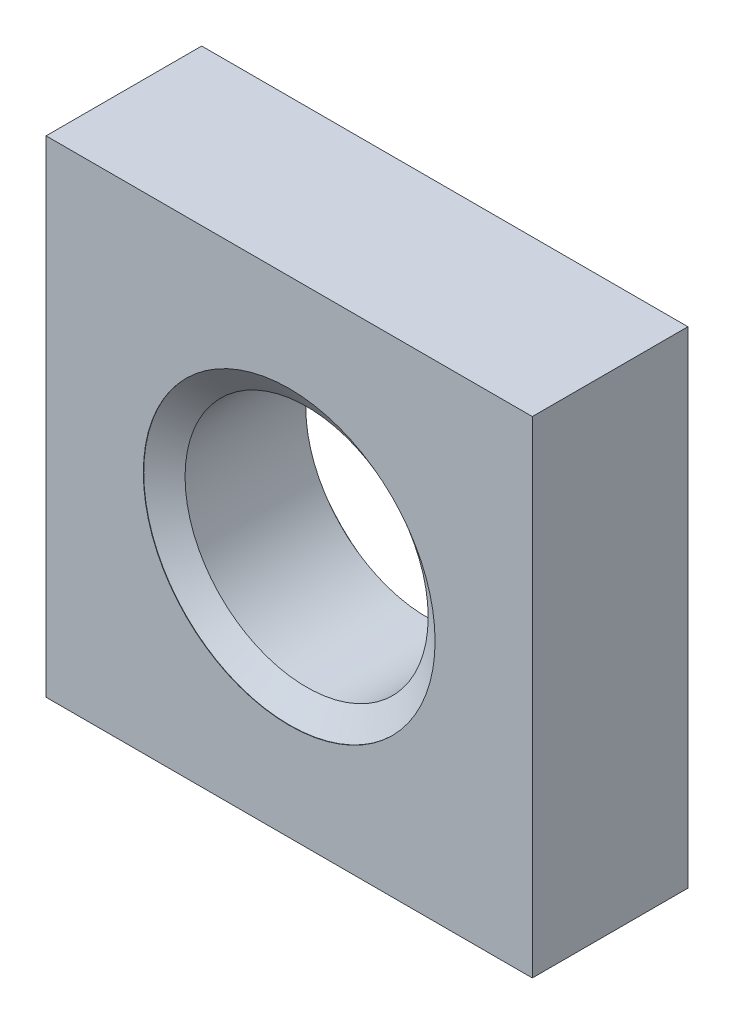
ISO-10303-21;
HEADER;
FILE_DESCRIPTION(('STEP AP214'),'2;1');
FILE_NAME('part.step','',(''),(''),'','','');
FILE_SCHEMA(('AUTOMOTIVE_DESIGN { 1 0 10303 214 1 1 1 1 }'));
ENDSEC;
DATA;
#1=APPLICATION_CONTEXT('core data for automotive mechanical design processes');
#2=APPLICATION_PROTOCOL_DEFINITION('international standard','automotive_design',2000,#1);
#3=PRODUCT_CONTEXT('',#1,'mechanical');
#4=PRODUCT('Part','Part','',(#3));
#5=PRODUCT_RELATED_PRODUCT_CATEGORY('part','',(#4));
#6=PRODUCT_DEFINITION_FORMATION('','',#4);
#7=PRODUCT_DEFINITION_CONTEXT('part definition',#1,'design');
#8=PRODUCT_DEFINITION('design','',#6,#7);
#9=PRODUCT_DEFINITION_SHAPE('','',#8);
#10=(LENGTH_UNIT() NAMED_UNIT(*) SI_UNIT(.MILLI.,.METRE.));
#11=(NAMED_UNIT(*) PLANE_ANGLE_UNIT() SI_UNIT($,.RADIAN.));
#12=(NAMED_UNIT(*) SI_UNIT($,.STERADIAN.) SOLID_ANGLE_UNIT());
#13=UNCERTAINTY_MEASURE_WITH_UNIT(LENGTH_MEASURE(1.E-05),#10,'distance_accuracy_value','');
#14=(GEOMETRIC_REPRESENTATION_CONTEXT(3) GLOBAL_UNCERTAINTY_ASSIGNED_CONTEXT((#13)) GLOBAL_UNIT_ASSIGNED_CONTEXT((#10,
#11,#12)) REPRESENTATION_CONTEXT('',''));
#15=CARTESIAN_POINT('',(0.,0.,0.));
#16=DIRECTION('',(0.,0.,1.));
#17=DIRECTION('',(1.,0.,0.));
#18=AXIS2_PLACEMENT_3D('',#15,#16,#17);
#19=CARTESIAN_POINT('',(0.,0.,-3.2));
#20=DIRECTION('',(0.,0.,1.));
#21=DIRECTION('',(1.,0.,0.));
#22=AXIS2_PLACEMENT_3D('',#19,#20,#21);
#23=CYLINDRICAL_SURFACE('',#22,2.5);
#24=CARTESIAN_POINT('',(0.,0.,-0.358103769104856));
#25=DIRECTION('',(0.,0.,1.));
#26=DIRECTION('',(1.,0.,0.));
#27=AXIS2_PLACEMENT_3D('',#24,#25,#26);
#28=CIRCLE('',#27,2.5);
#29=CARTESIAN_POINT('',(2.5,0.,-0.358103769104856));
#30=VERTEX_POINT('',#29);
#31=EDGE_CURVE('E117',#30,#30,#28,.F.);
#32=ORIENTED_EDGE('',*,*,#31,.F.);
#33=EDGE_LOOP('',(#32));
#34=FACE_BOUND('',#33,.T.);
#35=CARTESIAN_POINT('',(0.,0.,-2.84089623089514));
#36=DIRECTION('',(0.,0.,-1.));
#37=DIRECTION('',(-1.,0.,0.));
#38=AXIS2_PLACEMENT_3D('',#35,#36,#37);
#39=CIRCLE('',#38,2.5);
#40=CARTESIAN_POINT('',(-2.5,0.,-2.84089623089514));
#41=VERTEX_POINT('',#40);
#42=EDGE_CURVE('E41',#41,#41,#39,.F.);
#43=ORIENTED_EDGE('',*,*,#42,.F.);
#44=EDGE_LOOP('',(#43));
#45=FACE_BOUND('',#44,.T.);
#46=ADVANCED_FACE('F37',(#34,#45),#23,.F.);
#47=CARTESIAN_POINT('',(-5.,5.,-3.2));
#48=DIRECTION('',(0.,0.,-1.));
#49=DIRECTION('',(-1.,0.,0.));
#50=AXIS2_PLACEMENT_3D('',#47,#48,#49);
#51=PLANE('',#50);
#52=DIRECTION('',(0.,-1.,0.));
#53=VECTOR('',#52,1.);
#54=CARTESIAN_POINT('',(-5.,-5.,-3.2));
#55=LINE('',#54,#53);
#56=CARTESIAN_POINT('',(-5.,5.,-3.2));
#57=VERTEX_POINT('',#56);
#58=CARTESIAN_POINT('',(-5.,-5.,-3.2));
#59=VERTEX_POINT('',#58);
#60=EDGE_CURVE('E99',#57,#59,#55,.T.);
#61=ORIENTED_EDGE('',*,*,#60,.F.);
#62=DIRECTION('',(-1.,0.,0.));
#63=VECTOR('',#62,1.);
#64=CARTESIAN_POINT('',(-5.,5.,-3.2));
#65=LINE('',#64,#63);
#66=CARTESIAN_POINT('',(5.,5.,-3.2));
#67=VERTEX_POINT('',#66);
#68=EDGE_CURVE('E96',#67,#57,#65,.T.);
#69=ORIENTED_EDGE('',*,*,#68,.F.);
#70=DIRECTION('',(0.,1.,0.));
#71=VECTOR('',#70,1.);
#72=CARTESIAN_POINT('',(5.,-5.,-3.2));
#73=LINE('',#72,#71);
#74=CARTESIAN_POINT('',(5.,-5.,-3.2));
#75=VERTEX_POINT('',#74);
#76=EDGE_CURVE('E87',#75,#67,#73,.T.);
#77=ORIENTED_EDGE('',*,*,#76,.F.);
#78=DIRECTION('',(1.,0.,0.));
#79=VECTOR('',#78,1.);
#80=CARTESIAN_POINT('',(-5.,-5.,-3.2));
#81=LINE('',#80,#79);
#82=EDGE_CURVE('E95',#59,#75,#81,.T.);
#83=ORIENTED_EDGE('',*,*,#82,.F.);
#84=EDGE_LOOP('',(#61,#69,#77,#83));
#85=FACE_BOUND('',#84,.T.);
#86=CARTESIAN_POINT('',(0.,0.,-3.2));
#87=DIRECTION('',(0.,0.,-1.));
#88=DIRECTION('',(-1.,0.,0.));
#89=AXIS2_PLACEMENT_3D('',#86,#87,#88);
#90=CIRCLE('',#89,3.);
#91=CARTESIAN_POINT('',(-3.,0.,-3.2));
#92=VERTEX_POINT('',#91);
#93=EDGE_CURVE('E122',#92,#92,#90,.F.);
#94=ORIENTED_EDGE('',*,*,#93,.T.);
#95=EDGE_LOOP('',(#94));
#96=FACE_BOUND('',#95,.T.);
#97=ADVANCED_FACE('F93',(#85,#96),#51,.T.);
#98=CARTESIAN_POINT('',(-5.,5.,0.));
#99=DIRECTION('',(0.,0.,-1.));
#100=DIRECTION('',(-1.,0.,0.));
#101=AXIS2_PLACEMENT_3D('',#98,#99,#100);
#102=PLANE('',#101);
#103=DIRECTION('',(0.,-1.,0.));
#104=VECTOR('',#103,1.);
#105=CARTESIAN_POINT('',(-5.,-5.,0.));
#106=LINE('',#105,#104);
#107=CARTESIAN_POINT('',(-5.,5.,0.));
#108=VERTEX_POINT('',#107);
#109=CARTESIAN_POINT('',(-5.,-5.,0.));
#110=VERTEX_POINT('',#109);
#111=EDGE_CURVE('E106',#108,#110,#106,.T.);
#112=ORIENTED_EDGE('',*,*,#111,.T.);
#113=DIRECTION('',(1.,0.,0.));
#114=VECTOR('',#113,1.);
#115=CARTESIAN_POINT('',(-5.,-5.,0.));
#116=LINE('',#115,#114);
#117=CARTESIAN_POINT('',(5.,-5.,0.));
#118=VERTEX_POINT('',#117);
#119=EDGE_CURVE('E109',#110,#118,#116,.T.);
#120=ORIENTED_EDGE('',*,*,#119,.T.);
#121=DIRECTION('',(0.,1.,0.));
#122=VECTOR('',#121,1.);
#123=CARTESIAN_POINT('',(5.,-5.,0.));
#124=LINE('',#123,#122);
#125=CARTESIAN_POINT('',(5.,5.,0.));
#126=VERTEX_POINT('',#125);
#127=EDGE_CURVE('E89',#118,#126,#124,.T.);
#128=ORIENTED_EDGE('',*,*,#127,.T.);
#129=DIRECTION('',(-1.,0.,0.));
#130=VECTOR('',#129,1.);
#131=CARTESIAN_POINT('',(-5.,5.,0.));
#132=LINE('',#131,#130);
#133=EDGE_CURVE('E101',#126,#108,#132,.T.);
#134=ORIENTED_EDGE('',*,*,#133,.T.);
#135=EDGE_LOOP('',(#112,#120,#128,#134));
#136=FACE_BOUND('',#135,.T.);
#137=CARTESIAN_POINT('',(0.,0.,0.));
#138=DIRECTION('',(0.,0.,-1.));
#139=DIRECTION('',(-1.,0.,0.));
#140=AXIS2_PLACEMENT_3D('',#137,#138,#139);
#141=CIRCLE('',#140,3.);
#142=CARTESIAN_POINT('',(-3.,0.,0.));
#143=VERTEX_POINT('',#142);
#144=EDGE_CURVE('E110',#143,#143,#141,.F.);
#145=ORIENTED_EDGE('',*,*,#144,.F.);
#146=EDGE_LOOP('',(#145));
#147=FACE_BOUND('',#146,.T.);
#148=ADVANCED_FACE('F143',(#136,#147),#102,.F.);
#149=CARTESIAN_POINT('',(-5.,-5.,-3.2));
#150=DIRECTION('',(-1.,0.,0.));
#151=DIRECTION('',(0.,0.,1.));
#152=AXIS2_PLACEMENT_3D('',#149,#150,#151);
#153=PLANE('',#152);
#154=ORIENTED_EDGE('',*,*,#111,.F.);
#155=DIRECTION('',(0.,0.,1.));
#156=VECTOR('',#155,1.);
#157=CARTESIAN_POINT('',(-5.,5.,-3.2));
#158=LINE('',#157,#156);
#159=EDGE_CURVE('E11',#57,#108,#158,.T.);
#160=ORIENTED_EDGE('',*,*,#159,.F.);
#161=ORIENTED_EDGE('',*,*,#60,.T.);
#162=DIRECTION('',(0.,0.,1.));
#163=VECTOR('',#162,1.);
#164=CARTESIAN_POINT('',(-5.,-5.,-3.2));
#165=LINE('',#164,#163);
#166=EDGE_CURVE('E81',#59,#110,#165,.T.);
#167=ORIENTED_EDGE('',*,*,#166,.T.);
#168=EDGE_LOOP('',(#154,#160,#161,#167));
#169=FACE_BOUND('',#168,.T.);
#170=ADVANCED_FACE('F39',(#169),#153,.T.);
#171=CARTESIAN_POINT('',(-5.,5.,-3.2));
#172=DIRECTION('',(0.,1.,0.));
#173=DIRECTION('',(0.,0.,1.));
#174=AXIS2_PLACEMENT_3D('',#171,#172,#173);
#175=PLANE('',#174);
#176=ORIENTED_EDGE('',*,*,#133,.F.);
#177=DIRECTION('',(0.,0.,1.));
#178=VECTOR('',#177,1.);
#179=CARTESIAN_POINT('',(5.,5.,-3.2));
#180=LINE('',#179,#178);
#181=EDGE_CURVE('E47',#67,#126,#180,.T.);
#182=ORIENTED_EDGE('',*,*,#181,.F.);
#183=ORIENTED_EDGE('',*,*,#68,.T.);
#184=ORIENTED_EDGE('',*,*,#159,.T.);
#185=EDGE_LOOP('',(#176,#182,#183,#184));
#186=FACE_BOUND('',#185,.T.);
#187=ADVANCED_FACE('F151',(#186),#175,.T.);
#188=CARTESIAN_POINT('',(5.,-5.,-3.2));
#189=DIRECTION('',(1.,0.,0.));
#190=DIRECTION('',(0.,0.,-1.));
#191=AXIS2_PLACEMENT_3D('',#188,#189,#190);
#192=PLANE('',#191);
#193=ORIENTED_EDGE('',*,*,#127,.F.);
#194=DIRECTION('',(0.,0.,1.));
#195=VECTOR('',#194,1.);
#196=CARTESIAN_POINT('',(5.,-5.,-3.2));
#197=LINE('',#196,#195);
#198=EDGE_CURVE('E84',#75,#118,#197,.T.);
#199=ORIENTED_EDGE('',*,*,#198,.F.);
#200=ORIENTED_EDGE('',*,*,#76,.T.);
#201=ORIENTED_EDGE('',*,*,#181,.T.);
#202=EDGE_LOOP('',(#193,#199,#200,#201));
#203=FACE_BOUND('',#202,.T.);
#204=ADVANCED_FACE('F86',(#203),#192,.T.);
#205=CARTESIAN_POINT('',(-5.,-5.,-3.2));
#206=DIRECTION('',(0.,-1.,0.));
#207=DIRECTION('',(0.,0.,-1.));
#208=AXIS2_PLACEMENT_3D('',#205,#206,#207);
#209=PLANE('',#208);
#210=ORIENTED_EDGE('',*,*,#119,.F.);
#211=ORIENTED_EDGE('',*,*,#166,.F.);
#212=ORIENTED_EDGE('',*,*,#82,.T.);
#213=ORIENTED_EDGE('',*,*,#198,.T.);
#214=EDGE_LOOP('',(#210,#211,#212,#213));
#215=FACE_BOUND('',#214,.T.);
#216=ADVANCED_FACE('F98',(#215),#209,.T.);
#217=CARTESIAN_POINT('',(0.,0.,-25.0375057290932));
#218=DIRECTION('',(0.,0.,1.));
#219=DIRECTION('',(1.,0.,0.));
#220=AXIS2_PLACEMENT_3D('',#217,#218,#219);
#221=CYLINDRICAL_SURFACE('',#220,3.);
#222=CARTESIAN_POINT('',(0.,0.,-0.00800000000000106));
#223=DIRECTION('',(0.,0.,1.));
#224=DIRECTION('',(1.,0.,0.));
#225=AXIS2_PLACEMENT_3D('',#222,#223,#224);
#226=CIRCLE('',#225,3.);
#227=CARTESIAN_POINT('',(3.,0.,-0.00800000000000106));
#228=VERTEX_POINT('',#227);
#229=EDGE_CURVE('E120',#228,#228,#226,.T.);
#230=ORIENTED_EDGE('',*,*,#229,.F.);
#231=EDGE_LOOP('',(#230));
#232=FACE_BOUND('',#231,.T.);
#233=ORIENTED_EDGE('',*,*,#144,.T.);
#234=EDGE_LOOP('',(#233));
#235=FACE_BOUND('',#234,.T.);
#236=ADVANCED_FACE('F137',(#232,#235),#221,.F.);
#237=CARTESIAN_POINT('',(0.,0.,-0.393114146015342));
#238=DIRECTION('',(0.,0.,1.));
#239=DIRECTION('',(1.,0.,0.));
#240=AXIS2_PLACEMENT_3D('',#237,#238,#239);
#241=CONICAL_SURFACE('',#240,2.45,0.95993108859688);
#242=ORIENTED_EDGE('',*,*,#229,.T.);
#243=EDGE_LOOP('',(#242));
#244=FACE_BOUND('',#243,.T.);
#245=ORIENTED_EDGE('',*,*,#31,.T.);
#246=EDGE_LOOP('',(#245));
#247=FACE_BOUND('',#246,.T.);
#248=ADVANCED_FACE('F134',(#244,#247),#241,.F.);
#249=CARTESIAN_POINT('',(0.,0.,-3.191));
#250=DIRECTION('',(0.,0.,-1.));
#251=DIRECTION('',(-1.,0.,0.));
#252=AXIS2_PLACEMENT_3D('',#249,#250,#251);
#253=CONICAL_SURFACE('',#252,3.,0.959931088596881);
#254=CARTESIAN_POINT('',(0.,0.,-3.191));
#255=DIRECTION('',(0.,0.,1.));
#256=DIRECTION('',(1.,0.,0.));
#257=AXIS2_PLACEMENT_3D('',#254,#255,#256);
#258=CIRCLE('',#257,3.);
#259=CARTESIAN_POINT('',(3.,0.,-3.191));
#260=VERTEX_POINT('',#259);
#261=EDGE_CURVE('E124',#260,#260,#258,.T.);
#262=ORIENTED_EDGE('',*,*,#261,.F.);
#263=EDGE_LOOP('',(#262));
#264=FACE_BOUND('',#263,.T.);
#265=ORIENTED_EDGE('',*,*,#42,.T.);
#266=EDGE_LOOP('',(#265));
#267=FACE_BOUND('',#266,.T.);
#268=ADVANCED_FACE('F164',(#264,#267),#253,.F.);
#269=CARTESIAN_POINT('',(0.,0.,-25.0375057290932));
#270=DIRECTION('',(0.,0.,1.));
#271=DIRECTION('',(1.,0.,0.));
#272=AXIS2_PLACEMENT_3D('',#269,#270,#271);
#273=CYLINDRICAL_SURFACE('',#272,3.);
#274=ORIENTED_EDGE('',*,*,#93,.F.);
#275=EDGE_LOOP('',(#274));
#276=FACE_BOUND('',#275,.T.);
#277=ORIENTED_EDGE('',*,*,#261,.T.);
#278=EDGE_LOOP('',(#277));
#279=FACE_BOUND('',#278,.T.);
#280=ADVANCED_FACE('F165',(#276,#279),#273,.F.);
#281=CLOSED_SHELL('',(#46,#97,#148,#170,#187,#204,#216,#236,#248,#268,#280));
#282=MANIFOLD_SOLID_BREP('B2',#281);
#283=ADVANCED_BREP_SHAPE_REPRESENTATION('',(#18,#282),#14);
#284=SHAPE_DEFINITION_REPRESENTATION(#9,#283);
ENDSEC;
END-ISO-10303-21;
